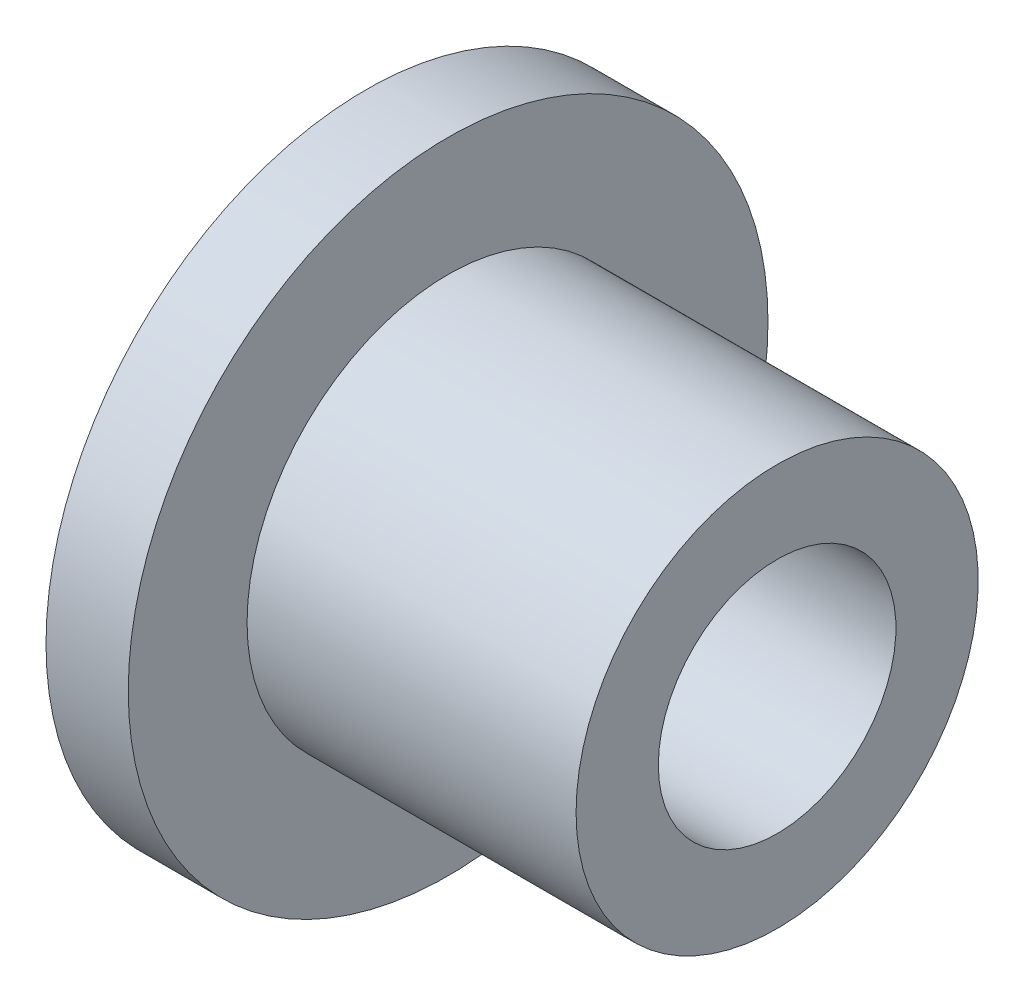
ISO-10303-21;
HEADER;
FILE_DESCRIPTION(('STEP AP214'),'2;1');
FILE_NAME('part.step','',(''),(''),'','','');
FILE_SCHEMA(('AUTOMOTIVE_DESIGN { 1 0 10303 214 1 1 1 1 }'));
ENDSEC;
DATA;
#1=APPLICATION_CONTEXT('core data for automotive mechanical design processes');
#2=APPLICATION_PROTOCOL_DEFINITION('international standard','automotive_design',2000,#1);
#3=PRODUCT_CONTEXT('',#1,'mechanical');
#4=PRODUCT('Part','Part','',(#3));
#5=PRODUCT_RELATED_PRODUCT_CATEGORY('part','',(#4));
#6=PRODUCT_DEFINITION_FORMATION('','',#4);
#7=PRODUCT_DEFINITION_CONTEXT('part definition',#1,'design');
#8=PRODUCT_DEFINITION('design','',#6,#7);
#9=PRODUCT_DEFINITION_SHAPE('','',#8);
#10=(LENGTH_UNIT() NAMED_UNIT(*) SI_UNIT(.MILLI.,.METRE.));
#11=(NAMED_UNIT(*) PLANE_ANGLE_UNIT() SI_UNIT($,.RADIAN.));
#12=(NAMED_UNIT(*) SI_UNIT($,.STERADIAN.) SOLID_ANGLE_UNIT());
#13=UNCERTAINTY_MEASURE_WITH_UNIT(LENGTH_MEASURE(1.E-05),#10,'distance_accuracy_value','');
#14=(GEOMETRIC_REPRESENTATION_CONTEXT(3) GLOBAL_UNCERTAINTY_ASSIGNED_CONTEXT((#13)) GLOBAL_UNIT_ASSIGNED_CONTEXT((#10,
#11,#12)) REPRESENTATION_CONTEXT('',''));
#15=CARTESIAN_POINT('',(0.,0.,0.));
#16=DIRECTION('',(0.,0.,1.));
#17=DIRECTION('',(1.,0.,0.));
#18=AXIS2_PLACEMENT_3D('',#15,#16,#17);
#19=CARTESIAN_POINT('',(0.,0.,0.));
#20=DIRECTION('',(-1.,0.,0.));
#21=DIRECTION('',(0.,0.,1.));
#22=AXIS2_PLACEMENT_3D('',#19,#20,#21);
#23=CYLINDRICAL_SURFACE('',#22,52.5);
#24=CARTESIAN_POINT('',(-1.80927835051547,0.,0.));
#25=DIRECTION('',(-1.,0.,0.));
#26=DIRECTION('',(0.,0.,1.));
#27=AXIS2_PLACEMENT_3D('',#24,#25,#26);
#28=CIRCLE('',#27,52.5);
#29=CARTESIAN_POINT('',(-1.80927835051547,0.,52.5));
#30=VERTEX_POINT('',#29);
#31=EDGE_CURVE('E72',#30,#30,#28,.T.);
#32=ORIENTED_EDGE('',*,*,#31,.F.);
#33=EDGE_LOOP('',(#32));
#34=FACE_BOUND('',#33,.T.);
#35=CARTESIAN_POINT('',(11.6907216494845,0.,0.));
#36=DIRECTION('',(-1.,0.,0.));
#37=DIRECTION('',(0.,0.,1.));
#38=AXIS2_PLACEMENT_3D('',#35,#36,#37);
#39=CIRCLE('',#38,52.5);
#40=CARTESIAN_POINT('',(11.6907216494845,0.,52.5));
#41=VERTEX_POINT('',#40);
#42=EDGE_CURVE('E10',#41,#41,#39,.T.);
#43=ORIENTED_EDGE('',*,*,#42,.T.);
#44=EDGE_LOOP('',(#43));
#45=FACE_BOUND('',#44,.T.);
#46=ADVANCED_FACE('F37',(#34,#45),#23,.T.);
#47=CARTESIAN_POINT('',(11.6907216494845,52.5,0.));
#48=DIRECTION('',(-1.,0.,0.));
#49=DIRECTION('',(0.,0.,1.));
#50=AXIS2_PLACEMENT_3D('',#47,#48,#49);
#51=PLANE('',#50);
#52=ORIENTED_EDGE('',*,*,#42,.F.);
#53=EDGE_LOOP('',(#52));
#54=FACE_BOUND('',#53,.T.);
#55=CARTESIAN_POINT('',(11.6907216494845,0.,0.));
#56=DIRECTION('',(-1.,0.,0.));
#57=DIRECTION('',(0.,0.,1.));
#58=AXIS2_PLACEMENT_3D('',#55,#56,#57);
#59=CIRCLE('',#58,33.);
#60=CARTESIAN_POINT('',(11.6907216494845,0.,33.));
#61=VERTEX_POINT('',#60);
#62=EDGE_CURVE('E44',#61,#61,#59,.T.);
#63=ORIENTED_EDGE('',*,*,#62,.T.);
#64=EDGE_LOOP('',(#63));
#65=FACE_BOUND('',#64,.T.);
#66=ADVANCED_FACE('F80',(#54,#65),#51,.F.);
#67=CARTESIAN_POINT('',(0.,0.,0.));
#68=DIRECTION('',(-1.,0.,0.));
#69=DIRECTION('',(0.,0.,1.));
#70=AXIS2_PLACEMENT_3D('',#67,#68,#69);
#71=CYLINDRICAL_SURFACE('',#70,33.);
#72=ORIENTED_EDGE('',*,*,#62,.F.);
#73=EDGE_LOOP('',(#72));
#74=FACE_BOUND('',#73,.T.);
#75=CARTESIAN_POINT('',(65.6907216494845,0.,0.));
#76=DIRECTION('',(-1.,0.,0.));
#77=DIRECTION('',(0.,0.,1.));
#78=AXIS2_PLACEMENT_3D('',#75,#76,#77);
#79=CIRCLE('',#78,33.);
#80=CARTESIAN_POINT('',(65.6907216494845,0.,33.));
#81=VERTEX_POINT('',#80);
#82=EDGE_CURVE('E49',#81,#81,#79,.T.);
#83=ORIENTED_EDGE('',*,*,#82,.T.);
#84=EDGE_LOOP('',(#83));
#85=FACE_BOUND('',#84,.T.);
#86=ADVANCED_FACE('F84',(#74,#85),#71,.T.);
#87=CARTESIAN_POINT('',(65.6907216494845,33.,0.));
#88=DIRECTION('',(-1.,0.,0.));
#89=DIRECTION('',(0.,0.,1.));
#90=AXIS2_PLACEMENT_3D('',#87,#88,#89);
#91=PLANE('',#90);
#92=ORIENTED_EDGE('',*,*,#82,.F.);
#93=EDGE_LOOP('',(#92));
#94=FACE_BOUND('',#93,.T.);
#95=CARTESIAN_POINT('',(65.6907216494845,0.,0.));
#96=DIRECTION('',(-1.,0.,0.));
#97=DIRECTION('',(0.,0.,1.));
#98=AXIS2_PLACEMENT_3D('',#95,#96,#97);
#99=CIRCLE('',#98,19.5);
#100=CARTESIAN_POINT('',(65.6907216494845,0.,19.5));
#101=VERTEX_POINT('',#100);
#102=EDGE_CURVE('E54',#101,#101,#99,.T.);
#103=ORIENTED_EDGE('',*,*,#102,.T.);
#104=EDGE_LOOP('',(#103));
#105=FACE_BOUND('',#104,.T.);
#106=ADVANCED_FACE('F89',(#94,#105),#91,.F.);
#107=CARTESIAN_POINT('',(0.,0.,0.));
#108=DIRECTION('',(-1.,0.,0.));
#109=DIRECTION('',(0.,0.,1.));
#110=AXIS2_PLACEMENT_3D('',#107,#108,#109);
#111=CYLINDRICAL_SURFACE('',#110,19.5);
#112=ORIENTED_EDGE('',*,*,#102,.F.);
#113=EDGE_LOOP('',(#112));
#114=FACE_BOUND('',#113,.T.);
#115=CARTESIAN_POINT('',(11.6907216494845,0.,0.));
#116=DIRECTION('',(-1.,0.,0.));
#117=DIRECTION('',(0.,0.,1.));
#118=AXIS2_PLACEMENT_3D('',#115,#116,#117);
#119=CIRCLE('',#118,19.5);
#120=CARTESIAN_POINT('',(11.6907216494845,0.,19.5));
#121=VERTEX_POINT('',#120);
#122=EDGE_CURVE('E60',#121,#121,#119,.T.);
#123=ORIENTED_EDGE('',*,*,#122,.T.);
#124=EDGE_LOOP('',(#123));
#125=FACE_BOUND('',#124,.T.);
#126=ADVANCED_FACE('F95',(#114,#125),#111,.F.);
#127=CARTESIAN_POINT('',(11.6907216494845,19.5,0.));
#128=DIRECTION('',(-1.,0.,0.));
#129=DIRECTION('',(0.,0.,1.));
#130=AXIS2_PLACEMENT_3D('',#127,#128,#129);
#131=PLANE('',#130);
#132=ORIENTED_EDGE('',*,*,#122,.F.);
#133=EDGE_LOOP('',(#132));
#134=FACE_BOUND('',#133,.T.);
#135=CARTESIAN_POINT('',(11.6907216494845,0.,0.));
#136=DIRECTION('',(-1.,0.,0.));
#137=DIRECTION('',(0.,0.,1.));
#138=AXIS2_PLACEMENT_3D('',#135,#136,#137);
#139=CIRCLE('',#138,15.);
#140=CARTESIAN_POINT('',(11.6907216494845,0.,15.));
#141=VERTEX_POINT('',#140);
#142=EDGE_CURVE('E64',#141,#141,#139,.T.);
#143=ORIENTED_EDGE('',*,*,#142,.T.);
#144=EDGE_LOOP('',(#143));
#145=FACE_BOUND('',#144,.T.);
#146=ADVANCED_FACE('F99',(#134,#145),#131,.F.);
#147=CARTESIAN_POINT('',(0.,0.,0.));
#148=DIRECTION('',(-1.,0.,0.));
#149=DIRECTION('',(0.,0.,1.));
#150=AXIS2_PLACEMENT_3D('',#147,#148,#149);
#151=CYLINDRICAL_SURFACE('',#150,15.);
#152=ORIENTED_EDGE('',*,*,#142,.F.);
#153=EDGE_LOOP('',(#152));
#154=FACE_BOUND('',#153,.T.);
#155=CARTESIAN_POINT('',(-1.80927835051547,0.,0.));
#156=DIRECTION('',(-1.,0.,0.));
#157=DIRECTION('',(0.,0.,1.));
#158=AXIS2_PLACEMENT_3D('',#155,#156,#157);
#159=CIRCLE('',#158,15.);
#160=CARTESIAN_POINT('',(-1.80927835051547,0.,15.));
#161=VERTEX_POINT('',#160);
#162=EDGE_CURVE('E68',#161,#161,#159,.T.);
#163=ORIENTED_EDGE('',*,*,#162,.T.);
#164=EDGE_LOOP('',(#163));
#165=FACE_BOUND('',#164,.T.);
#166=ADVANCED_FACE('F103',(#154,#165),#151,.F.);
#167=CARTESIAN_POINT('',(-1.80927835051547,52.5,0.));
#168=DIRECTION('',(1.,0.,0.));
#169=DIRECTION('',(0.,0.,-1.));
#170=AXIS2_PLACEMENT_3D('',#167,#168,#169);
#171=PLANE('',#170);
#172=ORIENTED_EDGE('',*,*,#162,.F.);
#173=EDGE_LOOP('',(#172));
#174=FACE_BOUND('',#173,.T.);
#175=ORIENTED_EDGE('',*,*,#31,.T.);
#176=EDGE_LOOP('',(#175));
#177=FACE_BOUND('',#176,.T.);
#178=ADVANCED_FACE('F77',(#174,#177),#171,.F.);
#179=CLOSED_SHELL('',(#46,#66,#86,#106,#126,#146,#166,#178));
#180=MANIFOLD_SOLID_BREP('B2',#179);
#181=ADVANCED_BREP_SHAPE_REPRESENTATION('',(#18,#180),#14);
#182=SHAPE_DEFINITION_REPRESENTATION(#9,#181);
ENDSEC;
END-ISO-10303-21;
